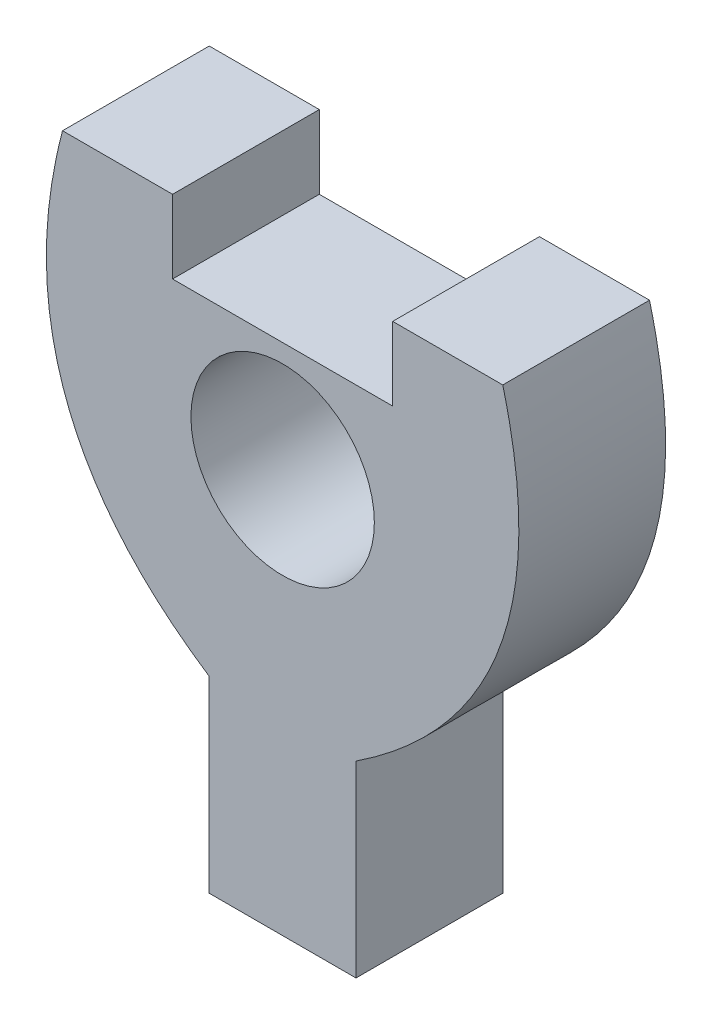
ISO-10303-21;
HEADER;
FILE_DESCRIPTION(('STEP AP214'),'2;1');
FILE_NAME('part.step','',(''),(''),'','','');
FILE_SCHEMA(('AUTOMOTIVE_DESIGN { 1 0 10303 214 1 1 1 1 }'));
ENDSEC;
DATA;
#1=APPLICATION_CONTEXT('core data for automotive mechanical design processes');
#2=APPLICATION_PROTOCOL_DEFINITION('international standard','automotive_design',2000,#1);
#3=PRODUCT_CONTEXT('',#1,'mechanical');
#4=PRODUCT('Part','Part','',(#3));
#5=PRODUCT_RELATED_PRODUCT_CATEGORY('part','',(#4));
#6=PRODUCT_DEFINITION_FORMATION('','',#4);
#7=PRODUCT_DEFINITION_CONTEXT('part definition',#1,'design');
#8=PRODUCT_DEFINITION('design','',#6,#7);
#9=PRODUCT_DEFINITION_SHAPE('','',#8);
#10=(LENGTH_UNIT() NAMED_UNIT(*) SI_UNIT(.MILLI.,.METRE.));
#11=(NAMED_UNIT(*) PLANE_ANGLE_UNIT() SI_UNIT($,.RADIAN.));
#12=(NAMED_UNIT(*) SI_UNIT($,.STERADIAN.) SOLID_ANGLE_UNIT());
#13=UNCERTAINTY_MEASURE_WITH_UNIT(LENGTH_MEASURE(1.E-05),#10,'distance_accuracy_value','');
#14=(GEOMETRIC_REPRESENTATION_CONTEXT(3) GLOBAL_UNCERTAINTY_ASSIGNED_CONTEXT((#13)) GLOBAL_UNIT_ASSIGNED_CONTEXT((#10,
#11,#12)) REPRESENTATION_CONTEXT('',''));
#15=CARTESIAN_POINT('',(0.,0.,0.));
#16=DIRECTION('',(0.,0.,1.));
#17=DIRECTION('',(1.,0.,0.));
#18=AXIS2_PLACEMENT_3D('',#15,#16,#17);
#19=CARTESIAN_POINT('',(0.,0.,4.));
#20=CARTESIAN_POINT('',(-8.12132034355964,3.87867965644036,4.));
#21=CARTESIAN_POINT('',(-6.,12.,4.));
#22=B_SPLINE_CURVE_WITH_KNOTS('',2,(#19,#20,#21),.UNSPECIFIED.,.F.,.F.,(3,3),(0.,1.),.UNSPECIFIED.);
#23=DIRECTION('',(0.,0.,-1.));
#24=VECTOR('',#23,1.);
#25=SURFACE_OF_LINEAR_EXTRUSION('',#22,#24);
#26=CARTESIAN_POINT('',(0.,0.,0.));
#27=CARTESIAN_POINT('',(-8.12132034355964,3.87867965644036,0.));
#28=CARTESIAN_POINT('',(-6.,12.,0.));
#29=B_SPLINE_CURVE_WITH_KNOTS('',2,(#26,#27,#28),.UNSPECIFIED.,.F.,.F.,(3,3),(0.,1.),.UNSPECIFIED.);
#30=CARTESIAN_POINT('',(-2.00000000009146,1.12054859730162,0.));
#31=VERTEX_POINT('',#30);
#32=CARTESIAN_POINT('',(-6.,12.,0.));
#33=VERTEX_POINT('',#32);
#34=EDGE_CURVE('E160',#31,#33,#29,.T.);
#35=ORIENTED_EDGE('',*,*,#34,.F.);
#36=DIRECTION('',(0.,0.,-1.));
#37=VECTOR('',#36,1.);
#38=CARTESIAN_POINT('',(-2.00000000009146,1.12054859730162,4.));
#39=LINE('',#38,#37);
#40=CARTESIAN_POINT('',(-2.00000000009146,1.12054859730162,4.));
#41=VERTEX_POINT('',#40);
#42=EDGE_CURVE('E11',#41,#31,#39,.T.);
#43=ORIENTED_EDGE('',*,*,#42,.F.);
#44=CARTESIAN_POINT('',(-6.,12.,4.));
#45=VERTEX_POINT('',#44);
#46=EDGE_CURVE('E207',#41,#45,#22,.T.);
#47=ORIENTED_EDGE('',*,*,#46,.T.);
#48=DIRECTION('',(0.,0.,-1.));
#49=VECTOR('',#48,1.);
#50=CARTESIAN_POINT('',(-6.,12.,4.));
#51=LINE('',#50,#49);
#52=EDGE_CURVE('E59',#45,#33,#51,.T.);
#53=ORIENTED_EDGE('',*,*,#52,.T.);
#54=EDGE_LOOP('',(#35,#43,#47,#53));
#55=FACE_BOUND('',#54,.T.);
#56=ADVANCED_FACE('F41',(#55),#25,.T.);
#57=CARTESIAN_POINT('',(-2.,0.,4.));
#58=DIRECTION('',(1.,0.,0.));
#59=DIRECTION('',(0.,1.,0.));
#60=AXIS2_PLACEMENT_3D('',#57,#58,#59);
#61=PLANE('',#60);
#62=DIRECTION('',(0.,-1.,0.));
#63=VECTOR('',#62,1.);
#64=CARTESIAN_POINT('',(-2.,0.,0.));
#65=LINE('',#64,#63);
#66=CARTESIAN_POINT('',(-2.,-4.,0.));
#67=VERTEX_POINT('',#66);
#68=EDGE_CURVE('E165',#31,#67,#65,.T.);
#69=ORIENTED_EDGE('',*,*,#68,.T.);
#70=DIRECTION('',(0.,0.,-1.));
#71=VECTOR('',#70,1.);
#72=CARTESIAN_POINT('',(-2.,-4.,4.));
#73=LINE('',#72,#71);
#74=CARTESIAN_POINT('',(-2.,-4.,4.));
#75=VERTEX_POINT('',#74);
#76=EDGE_CURVE('E51',#75,#67,#73,.T.);
#77=ORIENTED_EDGE('',*,*,#76,.F.);
#78=DIRECTION('',(0.,-1.,0.));
#79=VECTOR('',#78,1.);
#80=CARTESIAN_POINT('',(-2.,0.,4.));
#81=LINE('',#80,#79);
#82=EDGE_CURVE('E256',#41,#75,#81,.T.);
#83=ORIENTED_EDGE('',*,*,#82,.F.);
#84=ORIENTED_EDGE('',*,*,#42,.T.);
#85=EDGE_LOOP('',(#69,#77,#83,#84));
#86=FACE_BOUND('',#85,.T.);
#87=ADVANCED_FACE('F276',(#86),#61,.F.);
#88=CARTESIAN_POINT('',(0.,-4.,4.));
#89=DIRECTION('',(0.,1.,0.));
#90=DIRECTION('',(0.,0.,1.));
#91=AXIS2_PLACEMENT_3D('',#88,#89,#90);
#92=PLANE('',#91);
#93=DIRECTION('',(1.,0.,0.));
#94=VECTOR('',#93,1.);
#95=CARTESIAN_POINT('',(0.,-4.,0.));
#96=LINE('',#95,#94);
#97=CARTESIAN_POINT('',(2.,-4.,0.));
#98=VERTEX_POINT('',#97);
#99=EDGE_CURVE('E171',#67,#98,#96,.T.);
#100=ORIENTED_EDGE('',*,*,#99,.T.);
#101=DIRECTION('',(0.,0.,-1.));
#102=VECTOR('',#101,1.);
#103=CARTESIAN_POINT('',(2.,-4.,4.));
#104=LINE('',#103,#102);
#105=CARTESIAN_POINT('',(2.,-4.,4.));
#106=VERTEX_POINT('',#105);
#107=EDGE_CURVE('E225',#106,#98,#104,.T.);
#108=ORIENTED_EDGE('',*,*,#107,.F.);
#109=DIRECTION('',(1.,0.,0.));
#110=VECTOR('',#109,1.);
#111=CARTESIAN_POINT('',(0.,-4.,4.));
#112=LINE('',#111,#110);
#113=EDGE_CURVE('E235',#75,#106,#112,.T.);
#114=ORIENTED_EDGE('',*,*,#113,.F.);
#115=ORIENTED_EDGE('',*,*,#76,.T.);
#116=EDGE_LOOP('',(#100,#108,#114,#115));
#117=FACE_BOUND('',#116,.T.);
#118=ADVANCED_FACE('F233',(#117),#92,.F.);
#119=CARTESIAN_POINT('',(2.,0.,4.));
#120=DIRECTION('',(1.,0.,0.));
#121=DIRECTION('',(0.,1.,0.));
#122=AXIS2_PLACEMENT_3D('',#119,#120,#121);
#123=PLANE('',#122);
#124=DIRECTION('',(0.,-1.,0.));
#125=VECTOR('',#124,1.);
#126=CARTESIAN_POINT('',(2.,0.,0.));
#127=LINE('',#126,#125);
#128=CARTESIAN_POINT('',(2.00000000009145,1.12054859730162,0.));
#129=VERTEX_POINT('',#128);
#130=EDGE_CURVE('E175',#129,#98,#127,.T.);
#131=ORIENTED_EDGE('',*,*,#130,.F.);
#132=DIRECTION('',(0.,0.,-1.));
#133=VECTOR('',#132,1.);
#134=CARTESIAN_POINT('',(2.00000000009145,1.12054859730162,4.));
#135=LINE('',#134,#133);
#136=CARTESIAN_POINT('',(2.00000000009145,1.12054859730162,4.));
#137=VERTEX_POINT('',#136);
#138=EDGE_CURVE('E222',#137,#129,#135,.T.);
#139=ORIENTED_EDGE('',*,*,#138,.F.);
#140=DIRECTION('',(0.,-1.,0.));
#141=VECTOR('',#140,1.);
#142=CARTESIAN_POINT('',(2.,0.,4.));
#143=LINE('',#142,#141);
#144=EDGE_CURVE('E249',#137,#106,#143,.T.);
#145=ORIENTED_EDGE('',*,*,#144,.T.);
#146=ORIENTED_EDGE('',*,*,#107,.T.);
#147=EDGE_LOOP('',(#131,#139,#145,#146));
#148=FACE_BOUND('',#147,.T.);
#149=ADVANCED_FACE('F245',(#148),#123,.T.);
#150=CARTESIAN_POINT('',(0.,0.,4.));
#151=CARTESIAN_POINT('',(8.12132034355964,3.87867965644036,4.));
#152=CARTESIAN_POINT('',(6.,12.,4.));
#153=B_SPLINE_CURVE_WITH_KNOTS('',2,(#150,#151,#152),.UNSPECIFIED.,.F.,.F.,(3,3),(0.,1.),.UNSPECIFIED.);
#154=DIRECTION('',(0.,0.,-1.));
#155=VECTOR('',#154,1.);
#156=SURFACE_OF_LINEAR_EXTRUSION('',#153,#155);
#157=CARTESIAN_POINT('',(0.,0.,0.));
#158=CARTESIAN_POINT('',(8.12132034355964,3.87867965644036,0.));
#159=CARTESIAN_POINT('',(6.,12.,0.));
#160=B_SPLINE_CURVE_WITH_KNOTS('',2,(#157,#158,#159),.UNSPECIFIED.,.F.,.F.,(3,3),(0.,1.),.UNSPECIFIED.);
#161=CARTESIAN_POINT('',(6.,12.,0.));
#162=VERTEX_POINT('',#161);
#163=EDGE_CURVE('E179',#129,#162,#160,.T.);
#164=ORIENTED_EDGE('',*,*,#163,.T.);
#165=DIRECTION('',(0.,0.,-1.));
#166=VECTOR('',#165,1.);
#167=CARTESIAN_POINT('',(6.,12.,4.));
#168=LINE('',#167,#166);
#169=CARTESIAN_POINT('',(6.,12.,4.));
#170=VERTEX_POINT('',#169);
#171=EDGE_CURVE('E218',#170,#162,#168,.T.);
#172=ORIENTED_EDGE('',*,*,#171,.F.);
#173=EDGE_CURVE('E251',#137,#170,#153,.T.);
#174=ORIENTED_EDGE('',*,*,#173,.F.);
#175=ORIENTED_EDGE('',*,*,#138,.T.);
#176=EDGE_LOOP('',(#164,#172,#174,#175));
#177=FACE_BOUND('',#176,.T.);
#178=ADVANCED_FACE('F266',(#177),#156,.F.);
#179=CARTESIAN_POINT('',(0.,12.,4.));
#180=DIRECTION('',(0.,-1.,0.));
#181=DIRECTION('',(0.,0.,-1.));
#182=AXIS2_PLACEMENT_3D('',#179,#180,#181);
#183=PLANE('',#182);
#184=DIRECTION('',(-1.,0.,0.));
#185=VECTOR('',#184,1.);
#186=CARTESIAN_POINT('',(0.,12.,0.));
#187=LINE('',#186,#185);
#188=CARTESIAN_POINT('',(3.,12.,0.));
#189=VERTEX_POINT('',#188);
#190=EDGE_CURVE('E184',#162,#189,#187,.T.);
#191=ORIENTED_EDGE('',*,*,#190,.T.);
#192=DIRECTION('',(0.,0.,-1.));
#193=VECTOR('',#192,1.);
#194=CARTESIAN_POINT('',(3.,12.,4.));
#195=LINE('',#194,#193);
#196=CARTESIAN_POINT('',(3.,12.,4.));
#197=VERTEX_POINT('',#196);
#198=EDGE_CURVE('E214',#197,#189,#195,.T.);
#199=ORIENTED_EDGE('',*,*,#198,.F.);
#200=DIRECTION('',(-1.,0.,0.));
#201=VECTOR('',#200,1.);
#202=CARTESIAN_POINT('',(0.,12.,4.));
#203=LINE('',#202,#201);
#204=EDGE_CURVE('E150',#170,#197,#203,.T.);
#205=ORIENTED_EDGE('',*,*,#204,.F.);
#206=ORIENTED_EDGE('',*,*,#171,.T.);
#207=EDGE_LOOP('',(#191,#199,#205,#206));
#208=FACE_BOUND('',#207,.T.);
#209=ADVANCED_FACE('F270',(#208),#183,.F.);
#210=CARTESIAN_POINT('',(3.,0.,4.));
#211=DIRECTION('',(1.,0.,0.));
#212=DIRECTION('',(0.,0.,-1.));
#213=AXIS2_PLACEMENT_3D('',#210,#211,#212);
#214=PLANE('',#213);
#215=DIRECTION('',(0.,-1.,0.));
#216=VECTOR('',#215,1.);
#217=CARTESIAN_POINT('',(3.,0.,0.));
#218=LINE('',#217,#216);
#219=CARTESIAN_POINT('',(3.,10.,0.));
#220=VERTEX_POINT('',#219);
#221=EDGE_CURVE('E190',#189,#220,#218,.T.);
#222=ORIENTED_EDGE('',*,*,#221,.T.);
#223=DIRECTION('',(0.,0.,-1.));
#224=VECTOR('',#223,1.);
#225=CARTESIAN_POINT('',(3.,10.,4.));
#226=LINE('',#225,#224);
#227=CARTESIAN_POINT('',(3.,10.,4.));
#228=VERTEX_POINT('',#227);
#229=EDGE_CURVE('E132',#228,#220,#226,.T.);
#230=ORIENTED_EDGE('',*,*,#229,.F.);
#231=DIRECTION('',(0.,-1.,0.));
#232=VECTOR('',#231,1.);
#233=CARTESIAN_POINT('',(3.,0.,4.));
#234=LINE('',#233,#232);
#235=EDGE_CURVE('E145',#197,#228,#234,.T.);
#236=ORIENTED_EDGE('',*,*,#235,.F.);
#237=ORIENTED_EDGE('',*,*,#198,.T.);
#238=EDGE_LOOP('',(#222,#230,#236,#237));
#239=FACE_BOUND('',#238,.T.);
#240=ADVANCED_FACE('F303',(#239),#214,.F.);
#241=CARTESIAN_POINT('',(0.,10.,4.));
#242=DIRECTION('',(0.,1.,0.));
#243=DIRECTION('',(0.,0.,1.));
#244=AXIS2_PLACEMENT_3D('',#241,#242,#243);
#245=PLANE('',#244);
#246=DIRECTION('',(1.,0.,0.));
#247=VECTOR('',#246,1.);
#248=CARTESIAN_POINT('',(0.,10.,0.));
#249=LINE('',#248,#247);
#250=CARTESIAN_POINT('',(-3.,10.,0.));
#251=VERTEX_POINT('',#250);
#252=EDGE_CURVE('E128',#251,#220,#249,.T.);
#253=ORIENTED_EDGE('',*,*,#252,.F.);
#254=DIRECTION('',(0.,0.,-1.));
#255=VECTOR('',#254,1.);
#256=CARTESIAN_POINT('',(-3.,10.,4.));
#257=LINE('',#256,#255);
#258=CARTESIAN_POINT('',(-3.,10.,4.));
#259=VERTEX_POINT('',#258);
#260=EDGE_CURVE('E122',#259,#251,#257,.T.);
#261=ORIENTED_EDGE('',*,*,#260,.F.);
#262=DIRECTION('',(1.,0.,0.));
#263=VECTOR('',#262,1.);
#264=CARTESIAN_POINT('',(0.,10.,4.));
#265=LINE('',#264,#263);
#266=EDGE_CURVE('E126',#259,#228,#265,.T.);
#267=ORIENTED_EDGE('',*,*,#266,.T.);
#268=ORIENTED_EDGE('',*,*,#229,.T.);
#269=EDGE_LOOP('',(#253,#261,#267,#268));
#270=FACE_BOUND('',#269,.T.);
#271=ADVANCED_FACE('F124',(#270),#245,.T.);
#272=CARTESIAN_POINT('',(-3.,0.,4.));
#273=DIRECTION('',(-1.,0.,0.));
#274=DIRECTION('',(0.,0.,1.));
#275=AXIS2_PLACEMENT_3D('',#272,#273,#274);
#276=PLANE('',#275);
#277=DIRECTION('',(0.,1.,0.));
#278=VECTOR('',#277,1.);
#279=CARTESIAN_POINT('',(-3.,0.,0.));
#280=LINE('',#279,#278);
#281=CARTESIAN_POINT('',(-3.,12.,0.));
#282=VERTEX_POINT('',#281);
#283=EDGE_CURVE('E196',#251,#282,#280,.T.);
#284=ORIENTED_EDGE('',*,*,#283,.T.);
#285=DIRECTION('',(0.,0.,-1.));
#286=VECTOR('',#285,1.);
#287=CARTESIAN_POINT('',(-3.,12.,4.));
#288=LINE('',#287,#286);
#289=CARTESIAN_POINT('',(-3.,12.,4.));
#290=VERTEX_POINT('',#289);
#291=EDGE_CURVE('E91',#290,#282,#288,.T.);
#292=ORIENTED_EDGE('',*,*,#291,.F.);
#293=DIRECTION('',(0.,1.,0.));
#294=VECTOR('',#293,1.);
#295=CARTESIAN_POINT('',(-3.,0.,4.));
#296=LINE('',#295,#294);
#297=EDGE_CURVE('E134',#259,#290,#296,.T.);
#298=ORIENTED_EDGE('',*,*,#297,.F.);
#299=ORIENTED_EDGE('',*,*,#260,.T.);
#300=EDGE_LOOP('',(#284,#292,#298,#299));
#301=FACE_BOUND('',#300,.T.);
#302=ADVANCED_FACE('F135',(#301),#276,.F.);
#303=CARTESIAN_POINT('',(0.,12.,4.));
#304=DIRECTION('',(0.,1.,0.));
#305=DIRECTION('',(0.,0.,1.));
#306=AXIS2_PLACEMENT_3D('',#303,#304,#305);
#307=PLANE('',#306);
#308=DIRECTION('',(1.,0.,0.));
#309=VECTOR('',#308,1.);
#310=CARTESIAN_POINT('',(0.,12.,0.));
#311=LINE('',#310,#309);
#312=EDGE_CURVE('E199',#33,#282,#311,.T.);
#313=ORIENTED_EDGE('',*,*,#312,.F.);
#314=ORIENTED_EDGE('',*,*,#52,.F.);
#315=DIRECTION('',(1.,0.,0.));
#316=VECTOR('',#315,1.);
#317=CARTESIAN_POINT('',(0.,12.,4.));
#318=LINE('',#317,#316);
#319=EDGE_CURVE('E139',#45,#290,#318,.T.);
#320=ORIENTED_EDGE('',*,*,#319,.T.);
#321=ORIENTED_EDGE('',*,*,#291,.T.);
#322=EDGE_LOOP('',(#313,#314,#320,#321));
#323=FACE_BOUND('',#322,.T.);
#324=ADVANCED_FACE('F289',(#323),#307,.T.);
#325=CARTESIAN_POINT('',(0.,7.,4.));
#326=DIRECTION('',(0.,0.,-1.));
#327=DIRECTION('',(-1.,0.,0.));
#328=AXIS2_PLACEMENT_3D('',#325,#326,#327);
#329=CYLINDRICAL_SURFACE('',#328,2.5);
#330=CARTESIAN_POINT('',(0.,7.,4.));
#331=DIRECTION('',(0.,0.,1.));
#332=DIRECTION('',(1.,0.,0.));
#333=AXIS2_PLACEMENT_3D('',#330,#331,#332);
#334=CIRCLE('',#333,2.5);
#335=CARTESIAN_POINT('',(2.5,7.,4.));
#336=VERTEX_POINT('',#335);
#337=EDGE_CURVE('E156',#336,#336,#334,.T.);
#338=ORIENTED_EDGE('',*,*,#337,.T.);
#339=EDGE_LOOP('',(#338));
#340=FACE_BOUND('',#339,.T.);
#341=CARTESIAN_POINT('',(0.,7.,0.));
#342=DIRECTION('',(0.,0.,1.));
#343=DIRECTION('',(1.,0.,0.));
#344=AXIS2_PLACEMENT_3D('',#341,#342,#343);
#345=CIRCLE('',#344,2.5);
#346=CARTESIAN_POINT('',(2.5,7.,0.));
#347=VERTEX_POINT('',#346);
#348=EDGE_CURVE('E203',#347,#347,#345,.T.);
#349=ORIENTED_EDGE('',*,*,#348,.F.);
#350=EDGE_LOOP('',(#349));
#351=FACE_BOUND('',#350,.T.);
#352=ADVANCED_FACE('F291',(#340,#351),#329,.F.);
#353=CARTESIAN_POINT('',(0.,0.,4.));
#354=DIRECTION('',(0.,0.,1.));
#355=DIRECTION('',(1.,0.,0.));
#356=AXIS2_PLACEMENT_3D('',#353,#354,#355);
#357=PLANE('',#356);
#358=ORIENTED_EDGE('',*,*,#46,.F.);
#359=ORIENTED_EDGE('',*,*,#82,.T.);
#360=ORIENTED_EDGE('',*,*,#113,.T.);
#361=ORIENTED_EDGE('',*,*,#144,.F.);
#362=ORIENTED_EDGE('',*,*,#173,.T.);
#363=ORIENTED_EDGE('',*,*,#204,.T.);
#364=ORIENTED_EDGE('',*,*,#235,.T.);
#365=ORIENTED_EDGE('',*,*,#266,.F.);
#366=ORIENTED_EDGE('',*,*,#297,.T.);
#367=ORIENTED_EDGE('',*,*,#319,.F.);
#368=EDGE_LOOP('',(#358,#359,#360,#361,#362,#363,#364,#365,#366,#367));
#369=FACE_BOUND('',#368,.T.);
#370=ORIENTED_EDGE('',*,*,#337,.F.);
#371=EDGE_LOOP('',(#370));
#372=FACE_BOUND('',#371,.T.);
#373=ADVANCED_FACE('F142',(#369,#372),#357,.T.);
#374=CARTESIAN_POINT('',(0.,0.,0.));
#375=DIRECTION('',(0.,0.,1.));
#376=DIRECTION('',(1.,0.,0.));
#377=AXIS2_PLACEMENT_3D('',#374,#375,#376);
#378=PLANE('',#377);
#379=ORIENTED_EDGE('',*,*,#34,.T.);
#380=ORIENTED_EDGE('',*,*,#312,.T.);
#381=ORIENTED_EDGE('',*,*,#283,.F.);
#382=ORIENTED_EDGE('',*,*,#252,.T.);
#383=ORIENTED_EDGE('',*,*,#221,.F.);
#384=ORIENTED_EDGE('',*,*,#190,.F.);
#385=ORIENTED_EDGE('',*,*,#163,.F.);
#386=ORIENTED_EDGE('',*,*,#130,.T.);
#387=ORIENTED_EDGE('',*,*,#99,.F.);
#388=ORIENTED_EDGE('',*,*,#68,.F.);
#389=EDGE_LOOP('',(#379,#380,#381,#382,#383,#384,#385,#386,#387,#388));
#390=FACE_BOUND('',#389,.T.);
#391=ORIENTED_EDGE('',*,*,#348,.T.);
#392=EDGE_LOOP('',(#391));
#393=FACE_BOUND('',#392,.T.);
#394=ADVANCED_FACE('F239',(#390,#393),#378,.F.);
#395=CLOSED_SHELL('',(#56,#87,#118,#149,#178,#209,#240,#271,#302,#324,#352,#373,#394));
#396=MANIFOLD_SOLID_BREP('B2',#395);
#397=ADVANCED_BREP_SHAPE_REPRESENTATION('',(#18,#396),#14);
#398=SHAPE_DEFINITION_REPRESENTATION(#9,#397);
ENDSEC;
END-ISO-10303-21;
